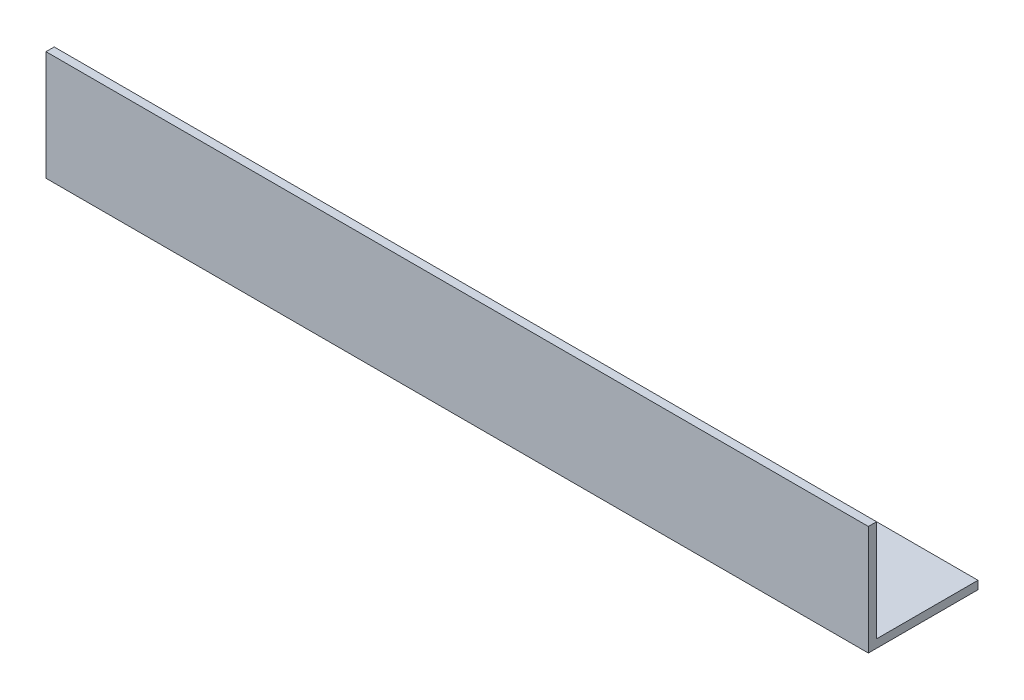
ISO-10303-21;
HEADER;
FILE_DESCRIPTION(('STEP AP214'),'2;1');
FILE_NAME('part.step','',(''),(''),'','','');
FILE_SCHEMA(('AUTOMOTIVE_DESIGN { 1 0 10303 214 1 1 1 1 }'));
ENDSEC;
DATA;
#1=APPLICATION_CONTEXT('core data for automotive mechanical design processes');
#2=APPLICATION_PROTOCOL_DEFINITION('international standard','automotive_design',2000,#1);
#3=PRODUCT_CONTEXT('',#1,'mechanical');
#4=PRODUCT('Part','Part','',(#3));
#5=PRODUCT_RELATED_PRODUCT_CATEGORY('part','',(#4));
#6=PRODUCT_DEFINITION_FORMATION('','',#4);
#7=PRODUCT_DEFINITION_CONTEXT('part definition',#1,'design');
#8=PRODUCT_DEFINITION('design','',#6,#7);
#9=PRODUCT_DEFINITION_SHAPE('','',#8);
#10=(LENGTH_UNIT() NAMED_UNIT(*) SI_UNIT(.MILLI.,.METRE.));
#11=(NAMED_UNIT(*) PLANE_ANGLE_UNIT() SI_UNIT($,.RADIAN.));
#12=(NAMED_UNIT(*) SI_UNIT($,.STERADIAN.) SOLID_ANGLE_UNIT());
#13=UNCERTAINTY_MEASURE_WITH_UNIT(LENGTH_MEASURE(1.E-05),#10,'distance_accuracy_value','');
#14=(GEOMETRIC_REPRESENTATION_CONTEXT(3) GLOBAL_UNCERTAINTY_ASSIGNED_CONTEXT((#13)) GLOBAL_UNIT_ASSIGNED_CONTEXT((#10,
#11,#12)) REPRESENTATION_CONTEXT('',''));
#15=CARTESIAN_POINT('',(0.,0.,0.));
#16=DIRECTION('',(0.,0.,1.));
#17=DIRECTION('',(1.,0.,0.));
#18=AXIS2_PLACEMENT_3D('',#15,#16,#17);
#19=CARTESIAN_POINT('',(300.,0.,0.));
#20=DIRECTION('',(0.,1.,0.));
#21=DIRECTION('',(0.,0.,1.));
#22=AXIS2_PLACEMENT_3D('',#19,#20,#21);
#23=PLANE('',#22);
#24=DIRECTION('',(0.,0.,-1.));
#25=VECTOR('',#24,1.);
#26=CARTESIAN_POINT('',(0.,0.,0.));
#27=LINE('',#26,#25);
#28=CARTESIAN_POINT('',(0.,0.,0.));
#29=VERTEX_POINT('',#28);
#30=CARTESIAN_POINT('',(0.,0.,-40.));
#31=VERTEX_POINT('',#30);
#32=EDGE_CURVE('E117',#29,#31,#27,.T.);
#33=ORIENTED_EDGE('',*,*,#32,.T.);
#34=DIRECTION('',(-1.,0.,0.));
#35=VECTOR('',#34,1.);
#36=CARTESIAN_POINT('',(300.,0.,-40.));
#37=LINE('',#36,#35);
#38=CARTESIAN_POINT('',(300.,0.,-40.));
#39=VERTEX_POINT('',#38);
#40=EDGE_CURVE('E11',#39,#31,#37,.T.);
#41=ORIENTED_EDGE('',*,*,#40,.F.);
#42=DIRECTION('',(0.,0.,-1.));
#43=VECTOR('',#42,1.);
#44=CARTESIAN_POINT('',(300.,0.,0.));
#45=LINE('',#44,#43);
#46=CARTESIAN_POINT('',(300.,0.,0.));
#47=VERTEX_POINT('',#46);
#48=EDGE_CURVE('E82',#47,#39,#45,.T.);
#49=ORIENTED_EDGE('',*,*,#48,.F.);
#50=DIRECTION('',(-1.,0.,0.));
#51=VECTOR('',#50,1.);
#52=CARTESIAN_POINT('',(300.,0.,0.));
#53=LINE('',#52,#51);
#54=EDGE_CURVE('E113',#47,#29,#53,.T.);
#55=ORIENTED_EDGE('',*,*,#54,.T.);
#56=EDGE_LOOP('',(#33,#41,#49,#55));
#57=FACE_BOUND('',#56,.T.);
#58=ADVANCED_FACE('F36',(#57),#23,.F.);
#59=CARTESIAN_POINT('',(300.,3.,-40.));
#60=DIRECTION('',(0.,0.,-1.));
#61=DIRECTION('',(-1.,0.,0.));
#62=AXIS2_PLACEMENT_3D('',#59,#60,#61);
#63=PLANE('',#62);
#64=DIRECTION('',(0.,-1.,0.));
#65=VECTOR('',#64,1.);
#66=CARTESIAN_POINT('',(0.,3.,-40.));
#67=LINE('',#66,#65);
#68=CARTESIAN_POINT('',(0.,3.,-40.));
#69=VERTEX_POINT('',#68);
#70=EDGE_CURVE('E120',#69,#31,#67,.T.);
#71=ORIENTED_EDGE('',*,*,#70,.F.);
#72=DIRECTION('',(-1.,0.,0.));
#73=VECTOR('',#72,1.);
#74=CARTESIAN_POINT('',(300.,3.,-40.));
#75=LINE('',#74,#73);
#76=CARTESIAN_POINT('',(300.,3.,-40.));
#77=VERTEX_POINT('',#76);
#78=EDGE_CURVE('E44',#77,#69,#75,.T.);
#79=ORIENTED_EDGE('',*,*,#78,.F.);
#80=DIRECTION('',(0.,-1.,0.));
#81=VECTOR('',#80,1.);
#82=CARTESIAN_POINT('',(300.,3.,-40.));
#83=LINE('',#82,#81);
#84=EDGE_CURVE('E222',#77,#39,#83,.T.);
#85=ORIENTED_EDGE('',*,*,#84,.T.);
#86=ORIENTED_EDGE('',*,*,#40,.T.);
#87=EDGE_LOOP('',(#71,#79,#85,#86));
#88=FACE_BOUND('',#87,.T.);
#89=ADVANCED_FACE('F138',(#88),#63,.T.);
#90=CARTESIAN_POINT('',(300.,3.,0.));
#91=DIRECTION('',(0.,1.,0.));
#92=DIRECTION('',(0.,0.,1.));
#93=AXIS2_PLACEMENT_3D('',#90,#91,#92);
#94=PLANE('',#93);
#95=DIRECTION('',(0.,0.,-1.));
#96=VECTOR('',#95,1.);
#97=CARTESIAN_POINT('',(0.,3.,0.));
#98=LINE('',#97,#96);
#99=CARTESIAN_POINT('',(0.,3.,-3.));
#100=VERTEX_POINT('',#99);
#101=EDGE_CURVE('E123',#100,#69,#98,.T.);
#102=ORIENTED_EDGE('',*,*,#101,.F.);
#103=DIRECTION('',(-1.,0.,0.));
#104=VECTOR('',#103,1.);
#105=CARTESIAN_POINT('',(300.,3.,-3.));
#106=LINE('',#105,#104);
#107=CARTESIAN_POINT('',(300.,3.,-3.));
#108=VERTEX_POINT('',#107);
#109=EDGE_CURVE('E103',#108,#100,#106,.T.);
#110=ORIENTED_EDGE('',*,*,#109,.F.);
#111=DIRECTION('',(0.,0.,-1.));
#112=VECTOR('',#111,1.);
#113=CARTESIAN_POINT('',(300.,3.,0.));
#114=LINE('',#113,#112);
#115=EDGE_CURVE('E109',#108,#77,#114,.T.);
#116=ORIENTED_EDGE('',*,*,#115,.T.);
#117=ORIENTED_EDGE('',*,*,#78,.T.);
#118=EDGE_LOOP('',(#102,#110,#116,#117));
#119=FACE_BOUND('',#118,.T.);
#120=ADVANCED_FACE('F135',(#119),#94,.T.);
#121=CARTESIAN_POINT('',(300.,0.,-3.));
#122=DIRECTION('',(0.,0.,-1.));
#123=DIRECTION('',(-1.,0.,0.));
#124=AXIS2_PLACEMENT_3D('',#121,#122,#123);
#125=PLANE('',#124);
#126=DIRECTION('',(0.,1.,0.));
#127=VECTOR('',#126,1.);
#128=CARTESIAN_POINT('',(0.,0.,-3.));
#129=LINE('',#128,#127);
#130=CARTESIAN_POINT('',(0.,40.,-3.));
#131=VERTEX_POINT('',#130);
#132=EDGE_CURVE('E98',#131,#100,#129,.F.);
#133=ORIENTED_EDGE('',*,*,#132,.F.);
#134=DIRECTION('',(-1.,0.,0.));
#135=VECTOR('',#134,1.);
#136=CARTESIAN_POINT('',(300.,40.,-3.));
#137=LINE('',#136,#135);
#138=CARTESIAN_POINT('',(300.,40.,-3.));
#139=VERTEX_POINT('',#138);
#140=EDGE_CURVE('E93',#139,#131,#137,.T.);
#141=ORIENTED_EDGE('',*,*,#140,.F.);
#142=DIRECTION('',(0.,1.,0.));
#143=VECTOR('',#142,1.);
#144=CARTESIAN_POINT('',(300.,0.,-3.));
#145=LINE('',#144,#143);
#146=EDGE_CURVE('E96',#139,#108,#145,.F.);
#147=ORIENTED_EDGE('',*,*,#146,.T.);
#148=ORIENTED_EDGE('',*,*,#109,.T.);
#149=EDGE_LOOP('',(#133,#141,#147,#148));
#150=FACE_BOUND('',#149,.T.);
#151=ADVANCED_FACE('F95',(#150),#125,.T.);
#152=CARTESIAN_POINT('',(300.,40.,0.));
#153=DIRECTION('',(0.,1.,0.));
#154=DIRECTION('',(0.,0.,1.));
#155=AXIS2_PLACEMENT_3D('',#152,#153,#154);
#156=PLANE('',#155);
#157=DIRECTION('',(0.,0.,-1.));
#158=VECTOR('',#157,1.);
#159=CARTESIAN_POINT('',(0.,40.,0.));
#160=LINE('',#159,#158);
#161=CARTESIAN_POINT('',(0.,40.,0.));
#162=VERTEX_POINT('',#161);
#163=EDGE_CURVE('E127',#162,#131,#160,.T.);
#164=ORIENTED_EDGE('',*,*,#163,.F.);
#165=DIRECTION('',(-1.,0.,0.));
#166=VECTOR('',#165,1.);
#167=CARTESIAN_POINT('',(300.,40.,0.));
#168=LINE('',#167,#166);
#169=CARTESIAN_POINT('',(300.,40.,0.));
#170=VERTEX_POINT('',#169);
#171=EDGE_CURVE('E73',#170,#162,#168,.T.);
#172=ORIENTED_EDGE('',*,*,#171,.F.);
#173=DIRECTION('',(0.,0.,-1.));
#174=VECTOR('',#173,1.);
#175=CARTESIAN_POINT('',(300.,40.,0.));
#176=LINE('',#175,#174);
#177=EDGE_CURVE('E107',#170,#139,#176,.T.);
#178=ORIENTED_EDGE('',*,*,#177,.T.);
#179=ORIENTED_EDGE('',*,*,#140,.T.);
#180=EDGE_LOOP('',(#164,#172,#178,#179));
#181=FACE_BOUND('',#180,.T.);
#182=ADVANCED_FACE('F111',(#181),#156,.T.);
#183=CARTESIAN_POINT('',(300.,0.,0.));
#184=DIRECTION('',(0.,0.,-1.));
#185=DIRECTION('',(-1.,0.,0.));
#186=AXIS2_PLACEMENT_3D('',#183,#184,#185);
#187=PLANE('',#186);
#188=DIRECTION('',(0.,-1.,0.));
#189=VECTOR('',#188,1.);
#190=CARTESIAN_POINT('',(0.,0.,0.));
#191=LINE('',#190,#189);
#192=EDGE_CURVE('E76',#162,#29,#191,.T.);
#193=ORIENTED_EDGE('',*,*,#192,.T.);
#194=ORIENTED_EDGE('',*,*,#54,.F.);
#195=DIRECTION('',(0.,-1.,0.));
#196=VECTOR('',#195,1.);
#197=CARTESIAN_POINT('',(300.,0.,0.));
#198=LINE('',#197,#196);
#199=EDGE_CURVE('E52',#170,#47,#198,.T.);
#200=ORIENTED_EDGE('',*,*,#199,.F.);
#201=ORIENTED_EDGE('',*,*,#171,.T.);
#202=EDGE_LOOP('',(#193,#194,#200,#201));
#203=FACE_BOUND('',#202,.T.);
#204=ADVANCED_FACE('F143',(#203),#187,.F.);
#205=CARTESIAN_POINT('',(300.,0.,0.));
#206=DIRECTION('',(-1.,0.,0.));
#207=DIRECTION('',(0.,0.,1.));
#208=AXIS2_PLACEMENT_3D('',#205,#206,#207);
#209=PLANE('',#208);
#210=ORIENTED_EDGE('',*,*,#48,.T.);
#211=ORIENTED_EDGE('',*,*,#84,.F.);
#212=ORIENTED_EDGE('',*,*,#115,.F.);
#213=ORIENTED_EDGE('',*,*,#146,.F.);
#214=ORIENTED_EDGE('',*,*,#177,.F.);
#215=ORIENTED_EDGE('',*,*,#199,.T.);
#216=EDGE_LOOP('',(#210,#211,#212,#213,#214,#215));
#217=FACE_BOUND('',#216,.T.);
#218=ADVANCED_FACE('F106',(#217),#209,.F.);
#219=CARTESIAN_POINT('',(0.,0.,0.));
#220=DIRECTION('',(-1.,0.,0.));
#221=DIRECTION('',(0.,0.,1.));
#222=AXIS2_PLACEMENT_3D('',#219,#220,#221);
#223=PLANE('',#222);
#224=ORIENTED_EDGE('',*,*,#32,.F.);
#225=ORIENTED_EDGE('',*,*,#192,.F.);
#226=ORIENTED_EDGE('',*,*,#163,.T.);
#227=ORIENTED_EDGE('',*,*,#132,.T.);
#228=ORIENTED_EDGE('',*,*,#101,.T.);
#229=ORIENTED_EDGE('',*,*,#70,.T.);
#230=EDGE_LOOP('',(#224,#225,#226,#227,#228,#229));
#231=FACE_BOUND('',#230,.T.);
#232=ADVANCED_FACE('F141',(#231),#223,.T.);
#233=CLOSED_SHELL('',(#58,#89,#120,#151,#182,#204,#218,#232));
#234=MANIFOLD_SOLID_BREP('B2',#233);
#235=ADVANCED_BREP_SHAPE_REPRESENTATION('',(#18,#234),#14);
#236=SHAPE_DEFINITION_REPRESENTATION(#9,#235);
ENDSEC;
END-ISO-10303-21;
